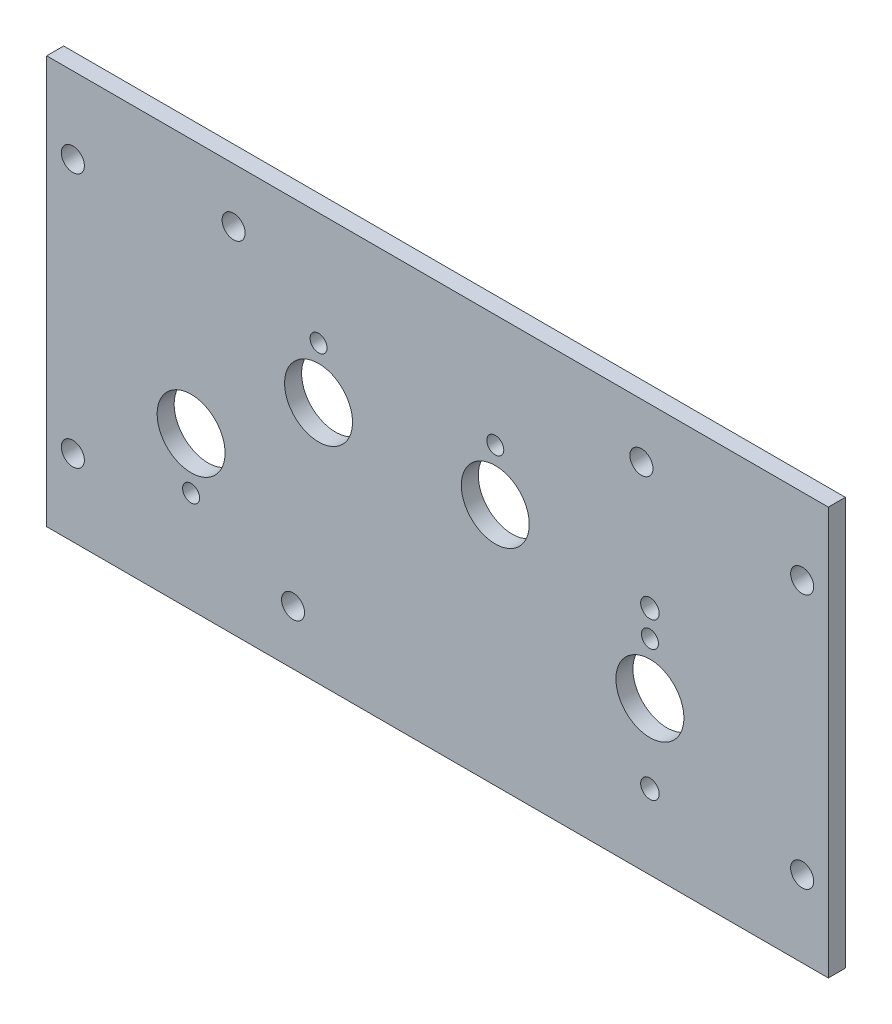
ISO-10303-21;
HEADER;
FILE_DESCRIPTION(('STEP AP214'),'2;1');
FILE_NAME('part.step','',(''),(''),'','','');
FILE_SCHEMA(('AUTOMOTIVE_DESIGN { 1 0 10303 214 1 1 1 1 }'));
ENDSEC;
DATA;
#1=APPLICATION_CONTEXT('core data for automotive mechanical design processes');
#2=APPLICATION_PROTOCOL_DEFINITION('international standard','automotive_design',2000,#1);
#3=PRODUCT_CONTEXT('',#1,'mechanical');
#4=PRODUCT('Part','Part','',(#3));
#5=PRODUCT_RELATED_PRODUCT_CATEGORY('part','',(#4));
#6=PRODUCT_DEFINITION_FORMATION('','',#4);
#7=PRODUCT_DEFINITION_CONTEXT('part definition',#1,'design');
#8=PRODUCT_DEFINITION('design','',#6,#7);
#9=PRODUCT_DEFINITION_SHAPE('','',#8);
#10=(LENGTH_UNIT() NAMED_UNIT(*) SI_UNIT(.MILLI.,.METRE.));
#11=(NAMED_UNIT(*) PLANE_ANGLE_UNIT() SI_UNIT($,.RADIAN.));
#12=(NAMED_UNIT(*) SI_UNIT($,.STERADIAN.) SOLID_ANGLE_UNIT());
#13=UNCERTAINTY_MEASURE_WITH_UNIT(LENGTH_MEASURE(1.E-05),#10,'distance_accuracy_value','');
#14=(GEOMETRIC_REPRESENTATION_CONTEXT(3) GLOBAL_UNCERTAINTY_ASSIGNED_CONTEXT((#13)) GLOBAL_UNIT_ASSIGNED_CONTEXT((#10,
#11,#12)) REPRESENTATION_CONTEXT('',''));
#15=CARTESIAN_POINT('',(0.,0.,0.));
#16=DIRECTION('',(0.,0.,1.));
#17=DIRECTION('',(1.,0.,0.));
#18=AXIS2_PLACEMENT_3D('',#15,#16,#17);
#19=CARTESIAN_POINT('',(0.,0.,-3.175));
#20=DIRECTION('',(1.,0.,0.));
#21=DIRECTION('',(0.,0.,-1.));
#22=AXIS2_PLACEMENT_3D('',#19,#20,#21);
#23=PLANE('',#22);
#24=DIRECTION('',(0.,1.,0.));
#25=VECTOR('',#24,1.);
#26=CARTESIAN_POINT('',(0.,0.,0.));
#27=LINE('',#26,#25);
#28=CARTESIAN_POINT('',(0.,0.,0.));
#29=VERTEX_POINT('',#28);
#30=CARTESIAN_POINT('',(0.,76.2,0.));
#31=VERTEX_POINT('',#30);
#32=EDGE_CURVE('E97',#29,#31,#27,.T.);
#33=ORIENTED_EDGE('',*,*,#32,.F.);
#34=DIRECTION('',(0.,0.,1.));
#35=VECTOR('',#34,1.);
#36=CARTESIAN_POINT('',(0.,0.,-3.175));
#37=LINE('',#36,#35);
#38=CARTESIAN_POINT('',(0.,0.,-3.175));
#39=VERTEX_POINT('',#38);
#40=EDGE_CURVE('E11',#39,#29,#37,.T.);
#41=ORIENTED_EDGE('',*,*,#40,.F.);
#42=DIRECTION('',(0.,1.,0.));
#43=VECTOR('',#42,1.);
#44=CARTESIAN_POINT('',(0.,0.,-3.175));
#45=LINE('',#44,#43);
#46=CARTESIAN_POINT('',(0.,76.2,-3.175));
#47=VERTEX_POINT('',#46);
#48=EDGE_CURVE('E90',#39,#47,#45,.T.);
#49=ORIENTED_EDGE('',*,*,#48,.T.);
#50=DIRECTION('',(0.,0.,1.));
#51=VECTOR('',#50,1.);
#52=CARTESIAN_POINT('',(0.,76.2,-3.175));
#53=LINE('',#52,#51);
#54=EDGE_CURVE('E35',#47,#31,#53,.T.);
#55=ORIENTED_EDGE('',*,*,#54,.T.);
#56=EDGE_LOOP('',(#33,#41,#49,#55));
#57=FACE_BOUND('',#56,.T.);
#58=ADVANCED_FACE('F32',(#57),#23,.T.);
#59=CARTESIAN_POINT('',(-146.05,0.,-3.175));
#60=DIRECTION('',(0.,-1.,0.));
#61=DIRECTION('',(1.,0.,0.));
#62=AXIS2_PLACEMENT_3D('',#59,#60,#61);
#63=PLANE('',#62);
#64=DIRECTION('',(1.,0.,0.));
#65=VECTOR('',#64,1.);
#66=CARTESIAN_POINT('',(-146.05,0.,0.));
#67=LINE('',#66,#65);
#68=CARTESIAN_POINT('',(-146.05,0.,0.));
#69=VERTEX_POINT('',#68);
#70=EDGE_CURVE('E92',#69,#29,#67,.T.);
#71=ORIENTED_EDGE('',*,*,#70,.F.);
#72=DIRECTION('',(0.,0.,1.));
#73=VECTOR('',#72,1.);
#74=CARTESIAN_POINT('',(-146.05,0.,-3.175));
#75=LINE('',#74,#73);
#76=CARTESIAN_POINT('',(-146.05,0.,-3.175));
#77=VERTEX_POINT('',#76);
#78=EDGE_CURVE('E41',#77,#69,#75,.T.);
#79=ORIENTED_EDGE('',*,*,#78,.F.);
#80=DIRECTION('',(1.,0.,0.));
#81=VECTOR('',#80,1.);
#82=CARTESIAN_POINT('',(-146.05,0.,-3.175));
#83=LINE('',#82,#81);
#84=EDGE_CURVE('E87',#77,#39,#83,.T.);
#85=ORIENTED_EDGE('',*,*,#84,.T.);
#86=ORIENTED_EDGE('',*,*,#40,.T.);
#87=EDGE_LOOP('',(#71,#79,#85,#86));
#88=FACE_BOUND('',#87,.T.);
#89=ADVANCED_FACE('F108',(#88),#63,.T.);
#90=CARTESIAN_POINT('',(-146.05,76.2,-3.175));
#91=DIRECTION('',(-1.,0.,0.));
#92=DIRECTION('',(0.,0.,1.));
#93=AXIS2_PLACEMENT_3D('',#90,#91,#92);
#94=PLANE('',#93);
#95=DIRECTION('',(0.,-1.,0.));
#96=VECTOR('',#95,1.);
#97=CARTESIAN_POINT('',(-146.05,76.2,0.));
#98=LINE('',#97,#96);
#99=CARTESIAN_POINT('',(-146.05,76.2,0.));
#100=VERTEX_POINT('',#99);
#101=EDGE_CURVE('E82',#100,#69,#98,.T.);
#102=ORIENTED_EDGE('',*,*,#101,.F.);
#103=DIRECTION('',(0.,0.,1.));
#104=VECTOR('',#103,1.);
#105=CARTESIAN_POINT('',(-146.05,76.2,-3.175));
#106=LINE('',#105,#104);
#107=CARTESIAN_POINT('',(-146.05,76.2,-3.175));
#108=VERTEX_POINT('',#107);
#109=EDGE_CURVE('E77',#108,#100,#106,.T.);
#110=ORIENTED_EDGE('',*,*,#109,.F.);
#111=DIRECTION('',(0.,-1.,0.));
#112=VECTOR('',#111,1.);
#113=CARTESIAN_POINT('',(-146.05,76.2,-3.175));
#114=LINE('',#113,#112);
#115=EDGE_CURVE('E80',#108,#77,#114,.T.);
#116=ORIENTED_EDGE('',*,*,#115,.T.);
#117=ORIENTED_EDGE('',*,*,#78,.T.);
#118=EDGE_LOOP('',(#102,#110,#116,#117));
#119=FACE_BOUND('',#118,.T.);
#120=ADVANCED_FACE('F79',(#119),#94,.T.);
#121=CARTESIAN_POINT('',(0.,76.2,-3.175));
#122=DIRECTION('',(0.,1.,0.));
#123=DIRECTION('',(0.,0.,1.));
#124=AXIS2_PLACEMENT_3D('',#121,#122,#123);
#125=PLANE('',#124);
#126=DIRECTION('',(-1.,0.,0.));
#127=VECTOR('',#126,1.);
#128=CARTESIAN_POINT('',(0.,76.2,0.));
#129=LINE('',#128,#127);
#130=EDGE_CURVE('E100',#31,#100,#129,.T.);
#131=ORIENTED_EDGE('',*,*,#130,.F.);
#132=ORIENTED_EDGE('',*,*,#54,.F.);
#133=DIRECTION('',(-1.,0.,0.));
#134=VECTOR('',#133,1.);
#135=CARTESIAN_POINT('',(0.,76.2,-3.175));
#136=LINE('',#135,#134);
#137=EDGE_CURVE('E86',#47,#108,#136,.T.);
#138=ORIENTED_EDGE('',*,*,#137,.T.);
#139=ORIENTED_EDGE('',*,*,#109,.T.);
#140=EDGE_LOOP('',(#131,#132,#138,#139));
#141=FACE_BOUND('',#140,.T.);
#142=ADVANCED_FACE('F89',(#141),#125,.T.);
#143=CARTESIAN_POINT('',(0.,0.,-3.175));
#144=DIRECTION('',(0.,0.,1.));
#145=DIRECTION('',(1.,0.,0.));
#146=AXIS2_PLACEMENT_3D('',#143,#144,#145);
#147=PLANE('',#146);
#148=CARTESIAN_POINT('',(-33.3375,43.18,-3.175));
#149=DIRECTION('',(0.,0.,-1.));
#150=DIRECTION('',(-1.,0.,0.));
#151=AXIS2_PLACEMENT_3D('',#148,#149,#150);
#152=CIRCLE('',#151,1.7272);
#153=CARTESIAN_POINT('',(-35.0647,43.18,-3.175));
#154=VERTEX_POINT('',#153);
#155=EDGE_CURVE('E204',#154,#154,#152,.T.);
#156=ORIENTED_EDGE('',*,*,#155,.F.);
#157=EDGE_LOOP('',(#156));
#158=FACE_BOUND('',#157,.T.);
#159=CARTESIAN_POINT('',(-33.3375,13.97,-3.175));
#160=DIRECTION('',(0.,0.,-1.));
#161=DIRECTION('',(-1.,0.,0.));
#162=AXIS2_PLACEMENT_3D('',#159,#160,#161);
#163=CIRCLE('',#162,1.7272);
#164=CARTESIAN_POINT('',(-35.0647,13.97,-3.175));
#165=VERTEX_POINT('',#164);
#166=EDGE_CURVE('E206',#165,#165,#163,.T.);
#167=ORIENTED_EDGE('',*,*,#166,.F.);
#168=EDGE_LOOP('',(#167));
#169=FACE_BOUND('',#168,.T.);
#170=CARTESIAN_POINT('',(-141.1605,61.9125,-3.175));
#171=DIRECTION('',(0.,0.,-1.));
#172=DIRECTION('',(-1.,0.,0.));
#173=AXIS2_PLACEMENT_3D('',#170,#171,#172);
#174=CIRCLE('',#173,2.15265000000001);
#175=CARTESIAN_POINT('',(-143.31315,61.9125,-3.175));
#176=VERTEX_POINT('',#175);
#177=EDGE_CURVE('E214',#176,#176,#174,.T.);
#178=ORIENTED_EDGE('',*,*,#177,.F.);
#179=EDGE_LOOP('',(#178));
#180=FACE_BOUND('',#179,.T.);
#181=CARTESIAN_POINT('',(-141.1605,14.2875,-3.175));
#182=DIRECTION('',(0.,0.,-1.));
#183=DIRECTION('',(-1.,0.,0.));
#184=AXIS2_PLACEMENT_3D('',#181,#182,#183);
#185=CIRCLE('',#184,2.15265000000001);
#186=CARTESIAN_POINT('',(-143.31315,14.2875,-3.175));
#187=VERTEX_POINT('',#186);
#188=EDGE_CURVE('E220',#187,#187,#185,.T.);
#189=ORIENTED_EDGE('',*,*,#188,.F.);
#190=EDGE_LOOP('',(#189));
#191=FACE_BOUND('',#190,.T.);
#192=CARTESIAN_POINT('',(-4.88949999999997,61.9125,-3.175));
#193=DIRECTION('',(0.,0.,-1.));
#194=DIRECTION('',(-1.,0.,0.));
#195=AXIS2_PLACEMENT_3D('',#192,#193,#194);
#196=CIRCLE('',#195,2.15265);
#197=CARTESIAN_POINT('',(-7.04214999999997,61.9125,-3.175));
#198=VERTEX_POINT('',#197);
#199=EDGE_CURVE('E226',#198,#198,#196,.T.);
#200=ORIENTED_EDGE('',*,*,#199,.F.);
#201=EDGE_LOOP('',(#200));
#202=FACE_BOUND('',#201,.T.);
#203=CARTESIAN_POINT('',(-4.88949999999995,14.2875,-3.175));
#204=DIRECTION('',(0.,0.,-1.));
#205=DIRECTION('',(-1.,0.,0.));
#206=AXIS2_PLACEMENT_3D('',#203,#204,#205);
#207=CIRCLE('',#206,2.15265);
#208=CARTESIAN_POINT('',(-7.04214999999995,14.2875,-3.175));
#209=VERTEX_POINT('',#208);
#210=EDGE_CURVE('E232',#209,#209,#207,.T.);
#211=ORIENTED_EDGE('',*,*,#210,.F.);
#212=EDGE_LOOP('',(#211));
#213=FACE_BOUND('',#212,.T.);
#214=CARTESIAN_POINT('',(-111.125,66.04,-3.175));
#215=DIRECTION('',(0.,0.,-1.));
#216=DIRECTION('',(-1.,0.,0.));
#217=AXIS2_PLACEMENT_3D('',#214,#215,#216);
#218=CIRCLE('',#217,2.15265000000001);
#219=CARTESIAN_POINT('',(-113.27765,66.04,-3.175));
#220=VERTEX_POINT('',#219);
#221=EDGE_CURVE('E238',#220,#220,#218,.T.);
#222=ORIENTED_EDGE('',*,*,#221,.F.);
#223=EDGE_LOOP('',(#222));
#224=FACE_BOUND('',#223,.T.);
#225=CARTESIAN_POINT('',(-100.01504,10.16,-3.175));
#226=DIRECTION('',(0.,0.,-1.));
#227=DIRECTION('',(-1.,0.,0.));
#228=AXIS2_PLACEMENT_3D('',#225,#226,#227);
#229=CIRCLE('',#228,2.15265000000001);
#230=CARTESIAN_POINT('',(-102.16769,10.16,-3.175));
#231=VERTEX_POINT('',#230);
#232=EDGE_CURVE('E244',#231,#231,#229,.T.);
#233=ORIENTED_EDGE('',*,*,#232,.F.);
#234=EDGE_LOOP('',(#233));
#235=FACE_BOUND('',#234,.T.);
#236=CARTESIAN_POINT('',(-34.925,66.04,-3.175));
#237=DIRECTION('',(0.,0.,-1.));
#238=DIRECTION('',(-1.,0.,0.));
#239=AXIS2_PLACEMENT_3D('',#236,#237,#238);
#240=CIRCLE('',#239,2.15265);
#241=CARTESIAN_POINT('',(-37.07765,66.04,-3.175));
#242=VERTEX_POINT('',#241);
#243=EDGE_CURVE('E250',#242,#242,#240,.T.);
#244=ORIENTED_EDGE('',*,*,#243,.F.);
#245=EDGE_LOOP('',(#244));
#246=FACE_BOUND('',#245,.T.);
#247=CARTESIAN_POINT('',(-95.25,45.466,-3.175));
#248=DIRECTION('',(0.,0.,-1.));
#249=DIRECTION('',(-1.,0.,0.));
#250=AXIS2_PLACEMENT_3D('',#247,#248,#249);
#251=CIRCLE('',#250,6.34999999999999);
#252=CARTESIAN_POINT('',(-101.6,45.466,-3.175));
#253=VERTEX_POINT('',#252);
#254=EDGE_CURVE('E256',#253,#253,#251,.T.);
#255=ORIENTED_EDGE('',*,*,#254,.F.);
#256=EDGE_LOOP('',(#255));
#257=FACE_BOUND('',#256,.T.);
#258=CARTESIAN_POINT('',(-119.0625,28.575,-3.175));
#259=DIRECTION('',(0.,0.,-1.));
#260=DIRECTION('',(-1.,0.,0.));
#261=AXIS2_PLACEMENT_3D('',#258,#259,#260);
#262=CIRCLE('',#261,6.34999999999999);
#263=CARTESIAN_POINT('',(-125.4125,28.575,-3.175));
#264=VERTEX_POINT('',#263);
#265=EDGE_CURVE('E262',#264,#264,#262,.T.);
#266=ORIENTED_EDGE('',*,*,#265,.F.);
#267=EDGE_LOOP('',(#266));
#268=FACE_BOUND('',#267,.T.);
#269=CARTESIAN_POINT('',(-62.23,45.466,-3.175));
#270=DIRECTION('',(0.,0.,-1.));
#271=DIRECTION('',(-1.,0.,0.));
#272=AXIS2_PLACEMENT_3D('',#269,#270,#271);
#273=CIRCLE('',#272,6.35);
#274=CARTESIAN_POINT('',(-68.58,45.466,-3.175));
#275=VERTEX_POINT('',#274);
#276=EDGE_CURVE('E268',#275,#275,#273,.T.);
#277=ORIENTED_EDGE('',*,*,#276,.F.);
#278=EDGE_LOOP('',(#277));
#279=FACE_BOUND('',#278,.T.);
#280=CARTESIAN_POINT('',(-33.3375,28.575,-3.175));
#281=DIRECTION('',(0.,0.,-1.));
#282=DIRECTION('',(-1.,0.,0.));
#283=AXIS2_PLACEMENT_3D('',#280,#281,#282);
#284=CIRCLE('',#283,6.35);
#285=CARTESIAN_POINT('',(-39.6875,28.575,-3.175));
#286=VERTEX_POINT('',#285);
#287=EDGE_CURVE('E274',#286,#286,#284,.T.);
#288=ORIENTED_EDGE('',*,*,#287,.F.);
#289=EDGE_LOOP('',(#288));
#290=FACE_BOUND('',#289,.T.);
#291=CARTESIAN_POINT('',(-95.25,55.118,-3.175));
#292=DIRECTION('',(0.,0.,-1.));
#293=DIRECTION('',(-1.,0.,0.));
#294=AXIS2_PLACEMENT_3D('',#291,#292,#293);
#295=CIRCLE('',#294,1.58749999999999);
#296=CARTESIAN_POINT('',(-96.8375,55.118,-3.175));
#297=VERTEX_POINT('',#296);
#298=EDGE_CURVE('E280',#297,#297,#295,.T.);
#299=ORIENTED_EDGE('',*,*,#298,.F.);
#300=EDGE_LOOP('',(#299));
#301=FACE_BOUND('',#300,.T.);
#302=CARTESIAN_POINT('',(-119.0625,18.923,-3.175));
#303=DIRECTION('',(0.,0.,-1.));
#304=DIRECTION('',(-1.,0.,0.));
#305=AXIS2_PLACEMENT_3D('',#302,#303,#304);
#306=CIRCLE('',#305,1.58749999999999);
#307=CARTESIAN_POINT('',(-120.65,18.923,-3.175));
#308=VERTEX_POINT('',#307);
#309=EDGE_CURVE('E286',#308,#308,#306,.T.);
#310=ORIENTED_EDGE('',*,*,#309,.F.);
#311=EDGE_LOOP('',(#310));
#312=FACE_BOUND('',#311,.T.);
#313=CARTESIAN_POINT('',(-62.23,55.118,-3.175));
#314=DIRECTION('',(0.,0.,-1.));
#315=DIRECTION('',(-1.,0.,0.));
#316=AXIS2_PLACEMENT_3D('',#313,#314,#315);
#317=CIRCLE('',#316,1.58749999999998);
#318=CARTESIAN_POINT('',(-63.8175,55.118,-3.175));
#319=VERTEX_POINT('',#318);
#320=EDGE_CURVE('E292',#319,#319,#317,.T.);
#321=ORIENTED_EDGE('',*,*,#320,.F.);
#322=EDGE_LOOP('',(#321));
#323=FACE_BOUND('',#322,.T.);
#324=CARTESIAN_POINT('',(-33.3375,38.227,-3.175));
#325=DIRECTION('',(0.,0.,-1.));
#326=DIRECTION('',(-1.,0.,0.));
#327=AXIS2_PLACEMENT_3D('',#324,#325,#326);
#328=CIRCLE('',#327,1.58749999999998);
#329=CARTESIAN_POINT('',(-34.925,38.227,-3.175));
#330=VERTEX_POINT('',#329);
#331=EDGE_CURVE('E298',#330,#330,#328,.T.);
#332=ORIENTED_EDGE('',*,*,#331,.F.);
#333=EDGE_LOOP('',(#332));
#334=FACE_BOUND('',#333,.T.);
#335=ORIENTED_EDGE('',*,*,#48,.F.);
#336=ORIENTED_EDGE('',*,*,#84,.F.);
#337=ORIENTED_EDGE('',*,*,#115,.F.);
#338=ORIENTED_EDGE('',*,*,#137,.F.);
#339=EDGE_LOOP('',(#335,#336,#337,#338));
#340=FACE_BOUND('',#339,.T.);
#341=ADVANCED_FACE('F85',(#158,#169,#180,#191,#202,#213,#224,#235,#246,#257,#268,#279,#290,#301,
#312,#323,#334,#340),#147,.F.);
#342=CARTESIAN_POINT('',(0.,0.,0.));
#343=DIRECTION('',(0.,0.,1.));
#344=DIRECTION('',(1.,0.,0.));
#345=AXIS2_PLACEMENT_3D('',#342,#343,#344);
#346=PLANE('',#345);
#347=CARTESIAN_POINT('',(-33.3375,43.18,0.));
#348=DIRECTION('',(0.,0.,-1.));
#349=DIRECTION('',(-1.,0.,0.));
#350=AXIS2_PLACEMENT_3D('',#347,#348,#349);
#351=CIRCLE('',#350,1.7272);
#352=CARTESIAN_POINT('',(-35.0647,43.18,0.));
#353=VERTEX_POINT('',#352);
#354=EDGE_CURVE('E202',#353,#353,#351,.T.);
#355=ORIENTED_EDGE('',*,*,#354,.T.);
#356=EDGE_LOOP('',(#355));
#357=FACE_BOUND('',#356,.T.);
#358=CARTESIAN_POINT('',(-33.3375,13.97,0.));
#359=DIRECTION('',(0.,0.,-1.));
#360=DIRECTION('',(-1.,0.,0.));
#361=AXIS2_PLACEMENT_3D('',#358,#359,#360);
#362=CIRCLE('',#361,1.7272);
#363=CARTESIAN_POINT('',(-35.0647,13.97,0.));
#364=VERTEX_POINT('',#363);
#365=EDGE_CURVE('E211',#364,#364,#362,.T.);
#366=ORIENTED_EDGE('',*,*,#365,.T.);
#367=EDGE_LOOP('',(#366));
#368=FACE_BOUND('',#367,.T.);
#369=CARTESIAN_POINT('',(-141.1605,61.9125,0.));
#370=DIRECTION('',(0.,0.,-1.));
#371=DIRECTION('',(-1.,0.,0.));
#372=AXIS2_PLACEMENT_3D('',#369,#370,#371);
#373=CIRCLE('',#372,2.15265000000001);
#374=CARTESIAN_POINT('',(-143.31315,61.9125,0.));
#375=VERTEX_POINT('',#374);
#376=EDGE_CURVE('E217',#375,#375,#373,.T.);
#377=ORIENTED_EDGE('',*,*,#376,.T.);
#378=EDGE_LOOP('',(#377));
#379=FACE_BOUND('',#378,.T.);
#380=CARTESIAN_POINT('',(-141.1605,14.2875,0.));
#381=DIRECTION('',(0.,0.,-1.));
#382=DIRECTION('',(-1.,0.,0.));
#383=AXIS2_PLACEMENT_3D('',#380,#381,#382);
#384=CIRCLE('',#383,2.15265000000001);
#385=CARTESIAN_POINT('',(-143.31315,14.2875,0.));
#386=VERTEX_POINT('',#385);
#387=EDGE_CURVE('E223',#386,#386,#384,.T.);
#388=ORIENTED_EDGE('',*,*,#387,.T.);
#389=EDGE_LOOP('',(#388));
#390=FACE_BOUND('',#389,.T.);
#391=CARTESIAN_POINT('',(-4.88949999999997,61.9125,0.));
#392=DIRECTION('',(0.,0.,-1.));
#393=DIRECTION('',(-1.,0.,0.));
#394=AXIS2_PLACEMENT_3D('',#391,#392,#393);
#395=CIRCLE('',#394,2.15265);
#396=CARTESIAN_POINT('',(-7.04214999999997,61.9125,0.));
#397=VERTEX_POINT('',#396);
#398=EDGE_CURVE('E229',#397,#397,#395,.T.);
#399=ORIENTED_EDGE('',*,*,#398,.T.);
#400=EDGE_LOOP('',(#399));
#401=FACE_BOUND('',#400,.T.);
#402=CARTESIAN_POINT('',(-4.88949999999995,14.2875,0.));
#403=DIRECTION('',(0.,0.,-1.));
#404=DIRECTION('',(-1.,0.,0.));
#405=AXIS2_PLACEMENT_3D('',#402,#403,#404);
#406=CIRCLE('',#405,2.15265);
#407=CARTESIAN_POINT('',(-7.04214999999995,14.2875,0.));
#408=VERTEX_POINT('',#407);
#409=EDGE_CURVE('E235',#408,#408,#406,.T.);
#410=ORIENTED_EDGE('',*,*,#409,.T.);
#411=EDGE_LOOP('',(#410));
#412=FACE_BOUND('',#411,.T.);
#413=CARTESIAN_POINT('',(-111.125,66.04,0.));
#414=DIRECTION('',(0.,0.,-1.));
#415=DIRECTION('',(-1.,0.,0.));
#416=AXIS2_PLACEMENT_3D('',#413,#414,#415);
#417=CIRCLE('',#416,2.15265000000001);
#418=CARTESIAN_POINT('',(-113.27765,66.04,0.));
#419=VERTEX_POINT('',#418);
#420=EDGE_CURVE('E241',#419,#419,#417,.T.);
#421=ORIENTED_EDGE('',*,*,#420,.T.);
#422=EDGE_LOOP('',(#421));
#423=FACE_BOUND('',#422,.T.);
#424=CARTESIAN_POINT('',(-100.01504,10.16,0.));
#425=DIRECTION('',(0.,0.,-1.));
#426=DIRECTION('',(-1.,0.,0.));
#427=AXIS2_PLACEMENT_3D('',#424,#425,#426);
#428=CIRCLE('',#427,2.15265000000001);
#429=CARTESIAN_POINT('',(-102.16769,10.16,0.));
#430=VERTEX_POINT('',#429);
#431=EDGE_CURVE('E247',#430,#430,#428,.T.);
#432=ORIENTED_EDGE('',*,*,#431,.T.);
#433=EDGE_LOOP('',(#432));
#434=FACE_BOUND('',#433,.T.);
#435=CARTESIAN_POINT('',(-34.925,66.04,0.));
#436=DIRECTION('',(0.,0.,-1.));
#437=DIRECTION('',(-1.,0.,0.));
#438=AXIS2_PLACEMENT_3D('',#435,#436,#437);
#439=CIRCLE('',#438,2.15265);
#440=CARTESIAN_POINT('',(-37.07765,66.04,0.));
#441=VERTEX_POINT('',#440);
#442=EDGE_CURVE('E253',#441,#441,#439,.T.);
#443=ORIENTED_EDGE('',*,*,#442,.T.);
#444=EDGE_LOOP('',(#443));
#445=FACE_BOUND('',#444,.T.);
#446=CARTESIAN_POINT('',(-95.25,45.466,0.));
#447=DIRECTION('',(0.,0.,-1.));
#448=DIRECTION('',(-1.,0.,0.));
#449=AXIS2_PLACEMENT_3D('',#446,#447,#448);
#450=CIRCLE('',#449,6.34999999999999);
#451=CARTESIAN_POINT('',(-101.6,45.466,0.));
#452=VERTEX_POINT('',#451);
#453=EDGE_CURVE('E259',#452,#452,#450,.T.);
#454=ORIENTED_EDGE('',*,*,#453,.T.);
#455=EDGE_LOOP('',(#454));
#456=FACE_BOUND('',#455,.T.);
#457=CARTESIAN_POINT('',(-119.0625,28.575,0.));
#458=DIRECTION('',(0.,0.,-1.));
#459=DIRECTION('',(-1.,0.,0.));
#460=AXIS2_PLACEMENT_3D('',#457,#458,#459);
#461=CIRCLE('',#460,6.34999999999999);
#462=CARTESIAN_POINT('',(-125.4125,28.575,0.));
#463=VERTEX_POINT('',#462);
#464=EDGE_CURVE('E265',#463,#463,#461,.T.);
#465=ORIENTED_EDGE('',*,*,#464,.T.);
#466=EDGE_LOOP('',(#465));
#467=FACE_BOUND('',#466,.T.);
#468=CARTESIAN_POINT('',(-62.23,45.466,0.));
#469=DIRECTION('',(0.,0.,-1.));
#470=DIRECTION('',(-1.,0.,0.));
#471=AXIS2_PLACEMENT_3D('',#468,#469,#470);
#472=CIRCLE('',#471,6.35);
#473=CARTESIAN_POINT('',(-68.58,45.466,0.));
#474=VERTEX_POINT('',#473);
#475=EDGE_CURVE('E271',#474,#474,#472,.T.);
#476=ORIENTED_EDGE('',*,*,#475,.T.);
#477=EDGE_LOOP('',(#476));
#478=FACE_BOUND('',#477,.T.);
#479=CARTESIAN_POINT('',(-33.3375,28.575,0.));
#480=DIRECTION('',(0.,0.,-1.));
#481=DIRECTION('',(-1.,0.,0.));
#482=AXIS2_PLACEMENT_3D('',#479,#480,#481);
#483=CIRCLE('',#482,6.35);
#484=CARTESIAN_POINT('',(-39.6875,28.575,0.));
#485=VERTEX_POINT('',#484);
#486=EDGE_CURVE('E277',#485,#485,#483,.T.);
#487=ORIENTED_EDGE('',*,*,#486,.T.);
#488=EDGE_LOOP('',(#487));
#489=FACE_BOUND('',#488,.T.);
#490=CARTESIAN_POINT('',(-95.25,55.118,0.));
#491=DIRECTION('',(0.,0.,-1.));
#492=DIRECTION('',(-1.,0.,0.));
#493=AXIS2_PLACEMENT_3D('',#490,#491,#492);
#494=CIRCLE('',#493,1.58750000000001);
#495=CARTESIAN_POINT('',(-96.8375,55.118,0.));
#496=VERTEX_POINT('',#495);
#497=EDGE_CURVE('E283',#496,#496,#494,.T.);
#498=ORIENTED_EDGE('',*,*,#497,.T.);
#499=EDGE_LOOP('',(#498));
#500=FACE_BOUND('',#499,.T.);
#501=CARTESIAN_POINT('',(-119.0625,18.923,0.));
#502=DIRECTION('',(0.,0.,-1.));
#503=DIRECTION('',(-1.,0.,0.));
#504=AXIS2_PLACEMENT_3D('',#501,#502,#503);
#505=CIRCLE('',#504,1.58750000000001);
#506=CARTESIAN_POINT('',(-120.65,18.923,0.));
#507=VERTEX_POINT('',#506);
#508=EDGE_CURVE('E289',#507,#507,#505,.T.);
#509=ORIENTED_EDGE('',*,*,#508,.T.);
#510=EDGE_LOOP('',(#509));
#511=FACE_BOUND('',#510,.T.);
#512=CARTESIAN_POINT('',(-62.23,55.118,0.));
#513=DIRECTION('',(0.,0.,-1.));
#514=DIRECTION('',(-1.,0.,0.));
#515=AXIS2_PLACEMENT_3D('',#512,#513,#514);
#516=CIRCLE('',#515,1.5875);
#517=CARTESIAN_POINT('',(-63.8175,55.118,0.));
#518=VERTEX_POINT('',#517);
#519=EDGE_CURVE('E295',#518,#518,#516,.T.);
#520=ORIENTED_EDGE('',*,*,#519,.T.);
#521=EDGE_LOOP('',(#520));
#522=FACE_BOUND('',#521,.T.);
#523=CARTESIAN_POINT('',(-33.3375,38.227,0.));
#524=DIRECTION('',(0.,0.,-1.));
#525=DIRECTION('',(-1.,0.,0.));
#526=AXIS2_PLACEMENT_3D('',#523,#524,#525);
#527=CIRCLE('',#526,1.5875);
#528=CARTESIAN_POINT('',(-34.925,38.227,0.));
#529=VERTEX_POINT('',#528);
#530=EDGE_CURVE('E101',#529,#529,#527,.T.);
#531=ORIENTED_EDGE('',*,*,#530,.T.);
#532=EDGE_LOOP('',(#531));
#533=FACE_BOUND('',#532,.T.);
#534=ORIENTED_EDGE('',*,*,#32,.T.);
#535=ORIENTED_EDGE('',*,*,#130,.T.);
#536=ORIENTED_EDGE('',*,*,#101,.T.);
#537=ORIENTED_EDGE('',*,*,#70,.T.);
#538=EDGE_LOOP('',(#534,#535,#536,#537));
#539=FACE_BOUND('',#538,.T.);
#540=ADVANCED_FACE('F107',(#357,#368,#379,#390,#401,#412,#423,#434,#445,#456,#467,#478,#489,
#500,#511,#522,#533,#539),#346,.T.);
#541=CARTESIAN_POINT('',(-33.3375,38.227,-3.175));
#542=DIRECTION('',(0.,0.,-1.));
#543=DIRECTION('',(-1.,0.,0.));
#544=AXIS2_PLACEMENT_3D('',#541,#542,#543);
#545=CYLINDRICAL_SURFACE('',#544,1.58749999999999);
#546=ORIENTED_EDGE('',*,*,#530,.F.);
#547=EDGE_LOOP('',(#546));
#548=FACE_BOUND('',#547,.T.);
#549=ORIENTED_EDGE('',*,*,#331,.T.);
#550=EDGE_LOOP('',(#549));
#551=FACE_BOUND('',#550,.T.);
#552=ADVANCED_FACE('F126',(#548,#551),#545,.F.);
#553=CARTESIAN_POINT('',(-62.23,55.118,-3.175));
#554=DIRECTION('',(0.,0.,-1.));
#555=DIRECTION('',(-1.,0.,0.));
#556=AXIS2_PLACEMENT_3D('',#553,#554,#555);
#557=CYLINDRICAL_SURFACE('',#556,1.58749999999999);
#558=ORIENTED_EDGE('',*,*,#519,.F.);
#559=EDGE_LOOP('',(#558));
#560=FACE_BOUND('',#559,.T.);
#561=ORIENTED_EDGE('',*,*,#320,.T.);
#562=EDGE_LOOP('',(#561));
#563=FACE_BOUND('',#562,.T.);
#564=ADVANCED_FACE('F133',(#560,#563),#557,.F.);
#565=CARTESIAN_POINT('',(-119.0625,18.923,-3.175));
#566=DIRECTION('',(0.,0.,-1.));
#567=DIRECTION('',(-1.,0.,0.));
#568=AXIS2_PLACEMENT_3D('',#565,#566,#567);
#569=CYLINDRICAL_SURFACE('',#568,1.5875);
#570=ORIENTED_EDGE('',*,*,#508,.F.);
#571=EDGE_LOOP('',(#570));
#572=FACE_BOUND('',#571,.T.);
#573=ORIENTED_EDGE('',*,*,#309,.T.);
#574=EDGE_LOOP('',(#573));
#575=FACE_BOUND('',#574,.T.);
#576=ADVANCED_FACE('F137',(#572,#575),#569,.F.);
#577=CARTESIAN_POINT('',(-95.25,55.118,-3.175));
#578=DIRECTION('',(0.,0.,-1.));
#579=DIRECTION('',(-1.,0.,0.));
#580=AXIS2_PLACEMENT_3D('',#577,#578,#579);
#581=CYLINDRICAL_SURFACE('',#580,1.5875);
#582=ORIENTED_EDGE('',*,*,#497,.F.);
#583=EDGE_LOOP('',(#582));
#584=FACE_BOUND('',#583,.T.);
#585=ORIENTED_EDGE('',*,*,#298,.T.);
#586=EDGE_LOOP('',(#585));
#587=FACE_BOUND('',#586,.T.);
#588=ADVANCED_FACE('F141',(#584,#587),#581,.F.);
#589=CARTESIAN_POINT('',(-33.3375,28.575,-3.175));
#590=DIRECTION('',(0.,0.,-1.));
#591=DIRECTION('',(-1.,0.,0.));
#592=AXIS2_PLACEMENT_3D('',#589,#590,#591);
#593=CYLINDRICAL_SURFACE('',#592,6.35);
#594=ORIENTED_EDGE('',*,*,#486,.F.);
#595=EDGE_LOOP('',(#594));
#596=FACE_BOUND('',#595,.T.);
#597=ORIENTED_EDGE('',*,*,#287,.T.);
#598=EDGE_LOOP('',(#597));
#599=FACE_BOUND('',#598,.T.);
#600=ADVANCED_FACE('F145',(#596,#599),#593,.F.);
#601=CARTESIAN_POINT('',(-62.23,45.466,-3.175));
#602=DIRECTION('',(0.,0.,-1.));
#603=DIRECTION('',(-1.,0.,0.));
#604=AXIS2_PLACEMENT_3D('',#601,#602,#603);
#605=CYLINDRICAL_SURFACE('',#604,6.35);
#606=ORIENTED_EDGE('',*,*,#475,.F.);
#607=EDGE_LOOP('',(#606));
#608=FACE_BOUND('',#607,.T.);
#609=ORIENTED_EDGE('',*,*,#276,.T.);
#610=EDGE_LOOP('',(#609));
#611=FACE_BOUND('',#610,.T.);
#612=ADVANCED_FACE('F149',(#608,#611),#605,.F.);
#613=CARTESIAN_POINT('',(-119.0625,28.575,-3.175));
#614=DIRECTION('',(0.,0.,-1.));
#615=DIRECTION('',(-1.,0.,0.));
#616=AXIS2_PLACEMENT_3D('',#613,#614,#615);
#617=CYLINDRICAL_SURFACE('',#616,6.34999999999999);
#618=ORIENTED_EDGE('',*,*,#464,.F.);
#619=EDGE_LOOP('',(#618));
#620=FACE_BOUND('',#619,.T.);
#621=ORIENTED_EDGE('',*,*,#265,.T.);
#622=EDGE_LOOP('',(#621));
#623=FACE_BOUND('',#622,.T.);
#624=ADVANCED_FACE('F153',(#620,#623),#617,.F.);
#625=CARTESIAN_POINT('',(-95.25,45.466,-3.175));
#626=DIRECTION('',(0.,0.,-1.));
#627=DIRECTION('',(-1.,0.,0.));
#628=AXIS2_PLACEMENT_3D('',#625,#626,#627);
#629=CYLINDRICAL_SURFACE('',#628,6.34999999999999);
#630=ORIENTED_EDGE('',*,*,#453,.F.);
#631=EDGE_LOOP('',(#630));
#632=FACE_BOUND('',#631,.T.);
#633=ORIENTED_EDGE('',*,*,#254,.T.);
#634=EDGE_LOOP('',(#633));
#635=FACE_BOUND('',#634,.T.);
#636=ADVANCED_FACE('F157',(#632,#635),#629,.F.);
#637=CARTESIAN_POINT('',(-34.925,66.04,-3.175));
#638=DIRECTION('',(0.,0.,-1.));
#639=DIRECTION('',(-1.,0.,0.));
#640=AXIS2_PLACEMENT_3D('',#637,#638,#639);
#641=CYLINDRICAL_SURFACE('',#640,2.15265);
#642=ORIENTED_EDGE('',*,*,#442,.F.);
#643=EDGE_LOOP('',(#642));
#644=FACE_BOUND('',#643,.T.);
#645=ORIENTED_EDGE('',*,*,#243,.T.);
#646=EDGE_LOOP('',(#645));
#647=FACE_BOUND('',#646,.T.);
#648=ADVANCED_FACE('F161',(#644,#647),#641,.F.);
#649=CARTESIAN_POINT('',(-100.01504,10.16,-3.175));
#650=DIRECTION('',(0.,0.,-1.));
#651=DIRECTION('',(-1.,0.,0.));
#652=AXIS2_PLACEMENT_3D('',#649,#650,#651);
#653=CYLINDRICAL_SURFACE('',#652,2.15265000000001);
#654=ORIENTED_EDGE('',*,*,#431,.F.);
#655=EDGE_LOOP('',(#654));
#656=FACE_BOUND('',#655,.T.);
#657=ORIENTED_EDGE('',*,*,#232,.T.);
#658=EDGE_LOOP('',(#657));
#659=FACE_BOUND('',#658,.T.);
#660=ADVANCED_FACE('F165',(#656,#659),#653,.F.);
#661=CARTESIAN_POINT('',(-111.125,66.04,-3.175));
#662=DIRECTION('',(0.,0.,-1.));
#663=DIRECTION('',(-1.,0.,0.));
#664=AXIS2_PLACEMENT_3D('',#661,#662,#663);
#665=CYLINDRICAL_SURFACE('',#664,2.15265000000001);
#666=ORIENTED_EDGE('',*,*,#420,.F.);
#667=EDGE_LOOP('',(#666));
#668=FACE_BOUND('',#667,.T.);
#669=ORIENTED_EDGE('',*,*,#221,.T.);
#670=EDGE_LOOP('',(#669));
#671=FACE_BOUND('',#670,.T.);
#672=ADVANCED_FACE('F169',(#668,#671),#665,.F.);
#673=CARTESIAN_POINT('',(-4.88949999999995,14.2875,-3.175));
#674=DIRECTION('',(0.,0.,-1.));
#675=DIRECTION('',(-1.,0.,0.));
#676=AXIS2_PLACEMENT_3D('',#673,#674,#675);
#677=CYLINDRICAL_SURFACE('',#676,2.15265);
#678=ORIENTED_EDGE('',*,*,#409,.F.);
#679=EDGE_LOOP('',(#678));
#680=FACE_BOUND('',#679,.T.);
#681=ORIENTED_EDGE('',*,*,#210,.T.);
#682=EDGE_LOOP('',(#681));
#683=FACE_BOUND('',#682,.T.);
#684=ADVANCED_FACE('F173',(#680,#683),#677,.F.);
#685=CARTESIAN_POINT('',(-4.88949999999997,61.9125,-3.175));
#686=DIRECTION('',(0.,0.,-1.));
#687=DIRECTION('',(-1.,0.,0.));
#688=AXIS2_PLACEMENT_3D('',#685,#686,#687);
#689=CYLINDRICAL_SURFACE('',#688,2.15265);
#690=ORIENTED_EDGE('',*,*,#398,.F.);
#691=EDGE_LOOP('',(#690));
#692=FACE_BOUND('',#691,.T.);
#693=ORIENTED_EDGE('',*,*,#199,.T.);
#694=EDGE_LOOP('',(#693));
#695=FACE_BOUND('',#694,.T.);
#696=ADVANCED_FACE('F177',(#692,#695),#689,.F.);
#697=CARTESIAN_POINT('',(-141.1605,14.2875,-3.175));
#698=DIRECTION('',(0.,0.,-1.));
#699=DIRECTION('',(-1.,0.,0.));
#700=AXIS2_PLACEMENT_3D('',#697,#698,#699);
#701=CYLINDRICAL_SURFACE('',#700,2.15265000000001);
#702=ORIENTED_EDGE('',*,*,#387,.F.);
#703=EDGE_LOOP('',(#702));
#704=FACE_BOUND('',#703,.T.);
#705=ORIENTED_EDGE('',*,*,#188,.T.);
#706=EDGE_LOOP('',(#705));
#707=FACE_BOUND('',#706,.T.);
#708=ADVANCED_FACE('F181',(#704,#707),#701,.F.);
#709=CARTESIAN_POINT('',(-141.1605,61.9125,-3.175));
#710=DIRECTION('',(0.,0.,-1.));
#711=DIRECTION('',(-1.,0.,0.));
#712=AXIS2_PLACEMENT_3D('',#709,#710,#711);
#713=CYLINDRICAL_SURFACE('',#712,2.15265000000001);
#714=ORIENTED_EDGE('',*,*,#376,.F.);
#715=EDGE_LOOP('',(#714));
#716=FACE_BOUND('',#715,.T.);
#717=ORIENTED_EDGE('',*,*,#177,.T.);
#718=EDGE_LOOP('',(#717));
#719=FACE_BOUND('',#718,.T.);
#720=ADVANCED_FACE('F185',(#716,#719),#713,.F.);
#721=CARTESIAN_POINT('',(-33.3375,13.97,-3.175));
#722=DIRECTION('',(0.,0.,-1.));
#723=DIRECTION('',(-1.,0.,0.));
#724=AXIS2_PLACEMENT_3D('',#721,#722,#723);
#725=CYLINDRICAL_SURFACE('',#724,1.7272);
#726=ORIENTED_EDGE('',*,*,#365,.F.);
#727=EDGE_LOOP('',(#726));
#728=FACE_BOUND('',#727,.T.);
#729=ORIENTED_EDGE('',*,*,#166,.T.);
#730=EDGE_LOOP('',(#729));
#731=FACE_BOUND('',#730,.T.);
#732=ADVANCED_FACE('F189',(#728,#731),#725,.F.);
#733=CARTESIAN_POINT('',(-33.3375,43.18,-3.175));
#734=DIRECTION('',(0.,0.,-1.));
#735=DIRECTION('',(-1.,0.,0.));
#736=AXIS2_PLACEMENT_3D('',#733,#734,#735);
#737=CYLINDRICAL_SURFACE('',#736,1.7272);
#738=ORIENTED_EDGE('',*,*,#354,.F.);
#739=EDGE_LOOP('',(#738));
#740=FACE_BOUND('',#739,.T.);
#741=ORIENTED_EDGE('',*,*,#155,.T.);
#742=EDGE_LOOP('',(#741));
#743=FACE_BOUND('',#742,.T.);
#744=ADVANCED_FACE('F193',(#740,#743),#737,.F.);
#745=CLOSED_SHELL('',(#58,#89,#120,#142,#341,#540,#552,#564,#576,#588,#600,#612,#624,#636,#648,
#660,#672,#684,#696,#708,#720,#732,#744));
#746=MANIFOLD_SOLID_BREP('B2',#745);
#747=ADVANCED_BREP_SHAPE_REPRESENTATION('',(#18,#746),#14);
#748=SHAPE_DEFINITION_REPRESENTATION(#9,#747);
ENDSEC;
END-ISO-10303-21;
